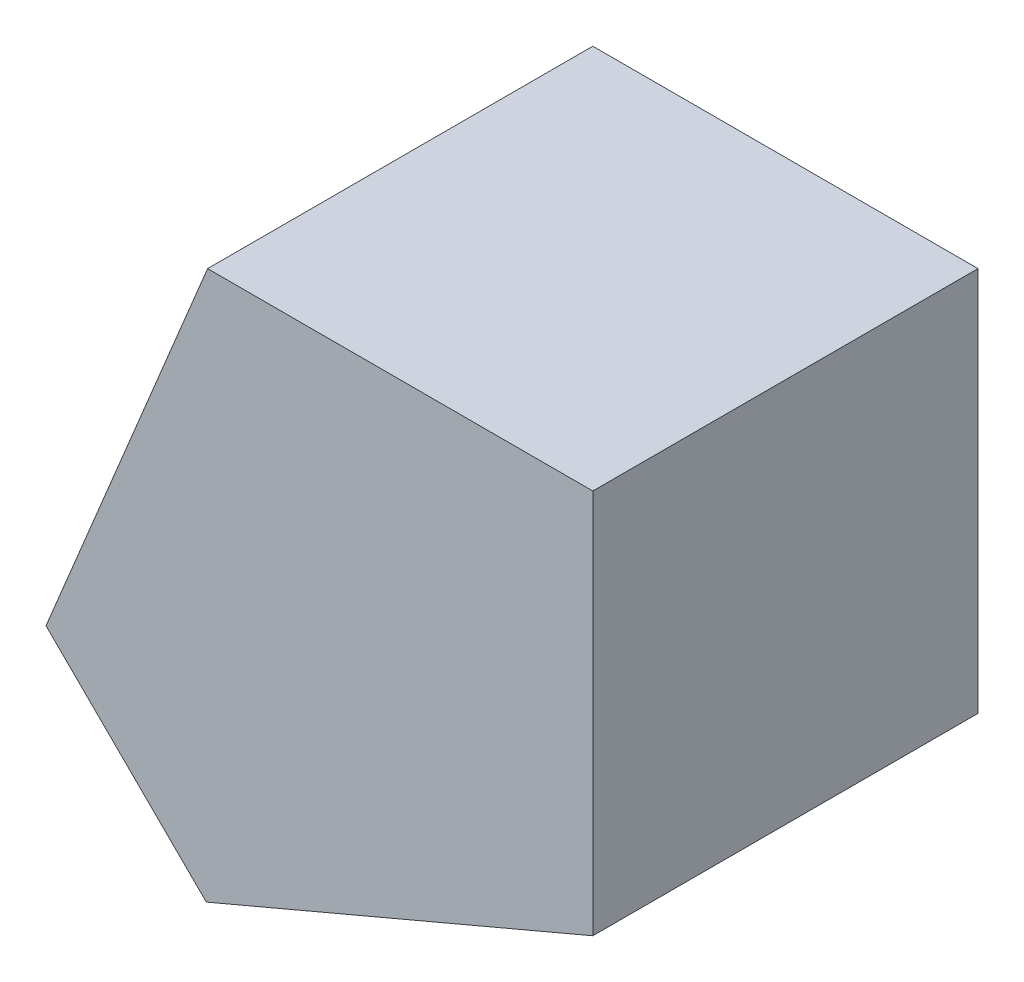
ISO-10303-21;
HEADER;
FILE_DESCRIPTION(('STEP AP214'),'2;1');
FILE_NAME('part.step','',(''),(''),'','','');
FILE_SCHEMA(('AUTOMOTIVE_DESIGN { 1 0 10303 214 1 1 1 1 }'));
ENDSEC;
DATA;
#1=APPLICATION_CONTEXT('core data for automotive mechanical design processes');
#2=APPLICATION_PROTOCOL_DEFINITION('international standard','automotive_design',2000,#1);
#3=PRODUCT_CONTEXT('',#1,'mechanical');
#4=PRODUCT('Part','Part','',(#3));
#5=PRODUCT_RELATED_PRODUCT_CATEGORY('part','',(#4));
#6=PRODUCT_DEFINITION_FORMATION('','',#4);
#7=PRODUCT_DEFINITION_CONTEXT('part definition',#1,'design');
#8=PRODUCT_DEFINITION('design','',#6,#7);
#9=PRODUCT_DEFINITION_SHAPE('','',#8);
#10=(LENGTH_UNIT() NAMED_UNIT(*) SI_UNIT(.MILLI.,.METRE.));
#11=(NAMED_UNIT(*) PLANE_ANGLE_UNIT() SI_UNIT($,.RADIAN.));
#12=(NAMED_UNIT(*) SI_UNIT($,.STERADIAN.) SOLID_ANGLE_UNIT());
#13=UNCERTAINTY_MEASURE_WITH_UNIT(LENGTH_MEASURE(1.E-05),#10,'distance_accuracy_value','');
#14=(GEOMETRIC_REPRESENTATION_CONTEXT(3) GLOBAL_UNCERTAINTY_ASSIGNED_CONTEXT((#13)) GLOBAL_UNIT_ASSIGNED_CONTEXT((#10,
#11,#12)) REPRESENTATION_CONTEXT('',''));
#15=CARTESIAN_POINT('',(0.,0.,0.));
#16=DIRECTION('',(0.,0.,1.));
#17=DIRECTION('',(1.,0.,0.));
#18=AXIS2_PLACEMENT_3D('',#15,#16,#17);
#19=CARTESIAN_POINT('',(11.6080110738356,9.11763884392623,5.));
#20=DIRECTION('',(-0.390731128489275,0.92050485345244,0.));
#21=DIRECTION('',(-0.92050485345244,-0.390731128489275,0.));
#22=AXIS2_PLACEMENT_3D('',#19,#20,#21);
#23=PLANE('',#22);
#24=DIRECTION('',(0.92050485345244,0.390731128489275,0.));
#25=VECTOR('',#24,1.);
#26=CARTESIAN_POINT('',(11.6080110738356,9.11763884392623,0.));
#27=LINE('',#26,#25);
#28=CARTESIAN_POINT('',(11.6080110738356,9.11763884392623,0.));
#29=VERTEX_POINT('',#28);
#30=CARTESIAN_POINT('',(16.6247625251513,11.2471234941928,0.));
#31=VERTEX_POINT('',#30);
#32=EDGE_CURVE('E109',#29,#31,#27,.T.);
#33=ORIENTED_EDGE('',*,*,#32,.T.);
#34=DIRECTION('',(0.,0.,-1.));
#35=VECTOR('',#34,1.);
#36=CARTESIAN_POINT('',(16.6247625251513,11.2471234941928,5.));
#37=LINE('',#36,#35);
#38=CARTESIAN_POINT('',(16.6247625251513,11.2471234941928,5.));
#39=VERTEX_POINT('',#38);
#40=EDGE_CURVE('E11',#39,#31,#37,.T.);
#41=ORIENTED_EDGE('',*,*,#40,.F.);
#42=DIRECTION('',(0.92050485345244,0.390731128489275,0.));
#43=VECTOR('',#42,1.);
#44=CARTESIAN_POINT('',(11.6080110738356,9.11763884392623,5.));
#45=LINE('',#44,#43);
#46=CARTESIAN_POINT('',(11.6080110738356,9.11763884392623,5.));
#47=VERTEX_POINT('',#46);
#48=EDGE_CURVE('E117',#47,#39,#45,.T.);
#49=ORIENTED_EDGE('',*,*,#48,.F.);
#50=DIRECTION('',(0.,0.,-1.));
#51=VECTOR('',#50,1.);
#52=CARTESIAN_POINT('',(11.6080110738356,9.11763884392623,5.));
#53=LINE('',#52,#51);
#54=EDGE_CURVE('E105',#47,#29,#53,.T.);
#55=ORIENTED_EDGE('',*,*,#54,.T.);
#56=EDGE_LOOP('',(#33,#41,#49,#55));
#57=FACE_BOUND('',#56,.T.);
#58=ADVANCED_FACE('F35',(#57),#23,.F.);
#59=CARTESIAN_POINT('',(16.6247625251513,11.2471234941928,5.));
#60=DIRECTION('',(-1.,0.,0.));
#61=DIRECTION('',(0.,0.,1.));
#62=AXIS2_PLACEMENT_3D('',#59,#60,#61);
#63=PLANE('',#62);
#64=DIRECTION('',(0.,1.,0.));
#65=VECTOR('',#64,1.);
#66=CARTESIAN_POINT('',(16.6247625251513,11.2471234941928,0.));
#67=LINE('',#66,#65);
#68=CARTESIAN_POINT('',(16.6247625251513,16.2471234941928,0.));
#69=VERTEX_POINT('',#68);
#70=EDGE_CURVE('E112',#31,#69,#67,.T.);
#71=ORIENTED_EDGE('',*,*,#70,.T.);
#72=DIRECTION('',(0.,0.,-1.));
#73=VECTOR('',#72,1.);
#74=CARTESIAN_POINT('',(16.6247625251513,16.2471234941928,5.));
#75=LINE('',#74,#73);
#76=CARTESIAN_POINT('',(16.6247625251513,16.2471234941928,5.));
#77=VERTEX_POINT('',#76);
#78=EDGE_CURVE('E43',#77,#69,#75,.T.);
#79=ORIENTED_EDGE('',*,*,#78,.F.);
#80=DIRECTION('',(0.,1.,0.));
#81=VECTOR('',#80,1.);
#82=CARTESIAN_POINT('',(16.6247625251513,11.2471234941928,5.));
#83=LINE('',#82,#81);
#84=EDGE_CURVE('E85',#39,#77,#83,.T.);
#85=ORIENTED_EDGE('',*,*,#84,.F.);
#86=ORIENTED_EDGE('',*,*,#40,.T.);
#87=EDGE_LOOP('',(#71,#79,#85,#86));
#88=FACE_BOUND('',#87,.T.);
#89=ADVANCED_FACE('F136',(#88),#63,.F.);
#90=CARTESIAN_POINT('',(16.6247625251513,16.2471234941928,5.));
#91=DIRECTION('',(0.,-1.,0.));
#92=DIRECTION('',(0.,0.,-1.));
#93=AXIS2_PLACEMENT_3D('',#90,#91,#92);
#94=PLANE('',#93);
#95=DIRECTION('',(-1.,0.,0.));
#96=VECTOR('',#95,1.);
#97=CARTESIAN_POINT('',(16.6247625251513,16.2471234941928,0.));
#98=LINE('',#97,#96);
#99=CARTESIAN_POINT('',(11.6247625251513,16.2471234941928,0.));
#100=VERTEX_POINT('',#99);
#101=EDGE_CURVE('E100',#69,#100,#98,.T.);
#102=ORIENTED_EDGE('',*,*,#101,.T.);
#103=DIRECTION('',(0.,0.,-1.));
#104=VECTOR('',#103,1.);
#105=CARTESIAN_POINT('',(11.6247625251513,16.2471234941928,5.));
#106=LINE('',#105,#104);
#107=CARTESIAN_POINT('',(11.6247625251513,16.2471234941928,5.));
#108=VERTEX_POINT('',#107);
#109=EDGE_CURVE('E97',#108,#100,#106,.T.);
#110=ORIENTED_EDGE('',*,*,#109,.F.);
#111=DIRECTION('',(-1.,0.,0.));
#112=VECTOR('',#111,1.);
#113=CARTESIAN_POINT('',(16.6247625251513,16.2471234941928,5.));
#114=LINE('',#113,#112);
#115=EDGE_CURVE('E89',#77,#108,#114,.T.);
#116=ORIENTED_EDGE('',*,*,#115,.F.);
#117=ORIENTED_EDGE('',*,*,#78,.T.);
#118=EDGE_LOOP('',(#102,#110,#116,#117));
#119=FACE_BOUND('',#118,.T.);
#120=ADVANCED_FACE('F98',(#119),#94,.F.);
#121=CARTESIAN_POINT('',(11.6247625251513,16.2471234941928,5.));
#122=DIRECTION('',(0.923879532511289,-0.382683432365084,0.));
#123=DIRECTION('',(0.382683432365084,0.923879532511289,0.));
#124=AXIS2_PLACEMENT_3D('',#121,#122,#123);
#125=PLANE('',#124);
#126=DIRECTION('',(-0.382683432365084,-0.923879532511289,0.));
#127=VECTOR('',#126,1.);
#128=CARTESIAN_POINT('',(11.6247625251513,16.2471234941928,0.));
#129=LINE('',#128,#127);
#130=CARTESIAN_POINT('',(9.52728838390192,11.1833729756615,0.));
#131=VERTEX_POINT('',#130);
#132=EDGE_CURVE('E71',#100,#131,#129,.T.);
#133=ORIENTED_EDGE('',*,*,#132,.T.);
#134=DIRECTION('',(0.,0.,-1.));
#135=VECTOR('',#134,1.);
#136=CARTESIAN_POINT('',(9.52728838390192,11.1833729756615,5.));
#137=LINE('',#136,#135);
#138=CARTESIAN_POINT('',(9.52728838390192,11.1833729756615,5.));
#139=VERTEX_POINT('',#138);
#140=EDGE_CURVE('E101',#139,#131,#137,.T.);
#141=ORIENTED_EDGE('',*,*,#140,.F.);
#142=DIRECTION('',(-0.382683432365084,-0.923879532511289,0.));
#143=VECTOR('',#142,1.);
#144=CARTESIAN_POINT('',(11.6247625251513,16.2471234941928,5.));
#145=LINE('',#144,#143);
#146=EDGE_CURVE('E93',#108,#139,#145,.T.);
#147=ORIENTED_EDGE('',*,*,#146,.F.);
#148=ORIENTED_EDGE('',*,*,#109,.T.);
#149=EDGE_LOOP('',(#133,#141,#147,#148));
#150=FACE_BOUND('',#149,.T.);
#151=ADVANCED_FACE('F103',(#150),#125,.F.);
#152=CARTESIAN_POINT('',(11.6080110738356,9.11763884392623,5.));
#153=DIRECTION('',(0.704546137762945,0.709658185159107,0.));
#154=DIRECTION('',(-0.709658185159107,0.704546137762945,0.));
#155=AXIS2_PLACEMENT_3D('',#152,#153,#154);
#156=PLANE('',#155);
#157=DIRECTION('',(0.709658185159107,-0.704546137762945,0.));
#158=VECTOR('',#157,1.);
#159=CARTESIAN_POINT('',(11.6080110738356,9.11763884392623,0.));
#160=LINE('',#159,#158);
#161=EDGE_CURVE('E77',#131,#29,#160,.T.);
#162=ORIENTED_EDGE('',*,*,#161,.T.);
#163=ORIENTED_EDGE('',*,*,#54,.F.);
#164=DIRECTION('',(0.709658185159107,-0.704546137762945,0.));
#165=VECTOR('',#164,1.);
#166=CARTESIAN_POINT('',(11.6080110738356,9.11763884392623,5.));
#167=LINE('',#166,#165);
#168=EDGE_CURVE('E51',#139,#47,#167,.T.);
#169=ORIENTED_EDGE('',*,*,#168,.F.);
#170=ORIENTED_EDGE('',*,*,#140,.T.);
#171=EDGE_LOOP('',(#162,#163,#169,#170));
#172=FACE_BOUND('',#171,.T.);
#173=ADVANCED_FACE('F125',(#172),#156,.F.);
#174=CARTESIAN_POINT('',(0.,0.,5.));
#175=DIRECTION('',(0.,0.,1.));
#176=DIRECTION('',(1.,0.,0.));
#177=AXIS2_PLACEMENT_3D('',#174,#175,#176);
#178=PLANE('',#177);
#179=ORIENTED_EDGE('',*,*,#48,.T.);
#180=ORIENTED_EDGE('',*,*,#84,.T.);
#181=ORIENTED_EDGE('',*,*,#115,.T.);
#182=ORIENTED_EDGE('',*,*,#146,.T.);
#183=ORIENTED_EDGE('',*,*,#168,.T.);
#184=EDGE_LOOP('',(#179,#180,#181,#182,#183));
#185=FACE_BOUND('',#184,.T.);
#186=ADVANCED_FACE('F91',(#185),#178,.T.);
#187=CARTESIAN_POINT('',(0.,0.,0.));
#188=DIRECTION('',(0.,0.,1.));
#189=DIRECTION('',(1.,0.,0.));
#190=AXIS2_PLACEMENT_3D('',#187,#188,#189);
#191=PLANE('',#190);
#192=ORIENTED_EDGE('',*,*,#32,.F.);
#193=ORIENTED_EDGE('',*,*,#161,.F.);
#194=ORIENTED_EDGE('',*,*,#132,.F.);
#195=ORIENTED_EDGE('',*,*,#101,.F.);
#196=ORIENTED_EDGE('',*,*,#70,.F.);
#197=EDGE_LOOP('',(#192,#193,#194,#195,#196));
#198=FACE_BOUND('',#197,.T.);
#199=ADVANCED_FACE('F121',(#198),#191,.F.);
#200=CLOSED_SHELL('',(#58,#89,#120,#151,#173,#186,#199));
#201=MANIFOLD_SOLID_BREP('B2',#200);
#202=ADVANCED_BREP_SHAPE_REPRESENTATION('',(#18,#201),#14);
#203=SHAPE_DEFINITION_REPRESENTATION(#9,#202);
ENDSEC;
END-ISO-10303-21;
